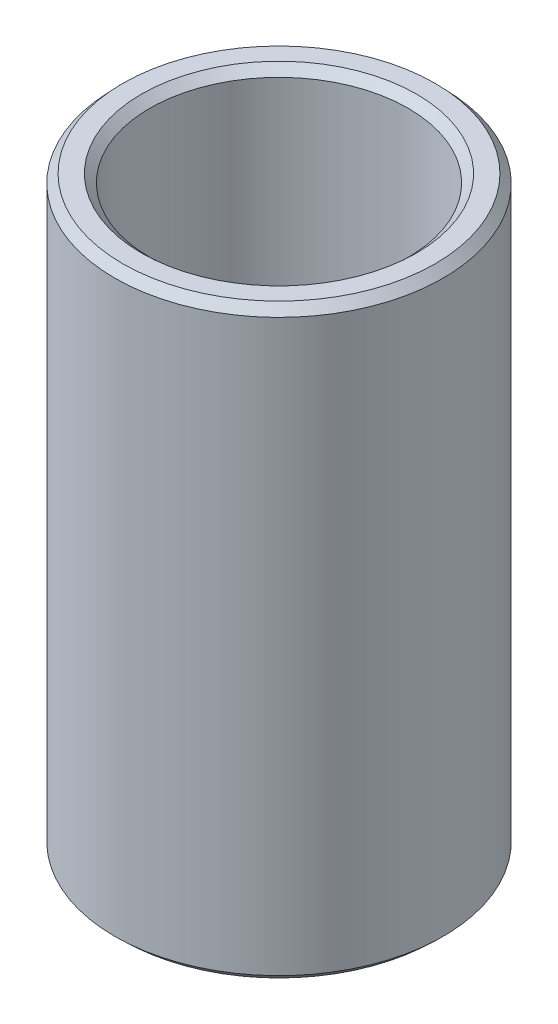
ISO-10303-21;
HEADER;
FILE_DESCRIPTION(('STEP AP214'),'2;1');
FILE_NAME('part.step','',(''),(''),'','','');
FILE_SCHEMA(('AUTOMOTIVE_DESIGN { 1 0 10303 214 1 1 1 1 }'));
ENDSEC;
DATA;
#1=APPLICATION_CONTEXT('core data for automotive mechanical design processes');
#2=APPLICATION_PROTOCOL_DEFINITION('international standard','automotive_design',2000,#1);
#3=PRODUCT_CONTEXT('',#1,'mechanical');
#4=PRODUCT('Part','Part','',(#3));
#5=PRODUCT_RELATED_PRODUCT_CATEGORY('part','',(#4));
#6=PRODUCT_DEFINITION_FORMATION('','',#4);
#7=PRODUCT_DEFINITION_CONTEXT('part definition',#1,'design');
#8=PRODUCT_DEFINITION('design','',#6,#7);
#9=PRODUCT_DEFINITION_SHAPE('','',#8);
#10=(LENGTH_UNIT() NAMED_UNIT(*) SI_UNIT(.MILLI.,.METRE.));
#11=(NAMED_UNIT(*) PLANE_ANGLE_UNIT() SI_UNIT($,.RADIAN.));
#12=(NAMED_UNIT(*) SI_UNIT($,.STERADIAN.) SOLID_ANGLE_UNIT());
#13=UNCERTAINTY_MEASURE_WITH_UNIT(LENGTH_MEASURE(1.E-05),#10,'distance_accuracy_value','');
#14=(GEOMETRIC_REPRESENTATION_CONTEXT(3) GLOBAL_UNCERTAINTY_ASSIGNED_CONTEXT((#13)) GLOBAL_UNIT_ASSIGNED_CONTEXT((#10,
#11,#12)) REPRESENTATION_CONTEXT('',''));
#15=CARTESIAN_POINT('',(0.,0.,0.));
#16=DIRECTION('',(0.,0.,1.));
#17=DIRECTION('',(1.,0.,0.));
#18=AXIS2_PLACEMENT_3D('',#15,#16,#17);
#19=CARTESIAN_POINT('',(0.,205.373040129439,0.));
#20=DIRECTION('',(0.,-1.,0.));
#21=DIRECTION('',(0.,0.,-1.));
#22=AXIS2_PLACEMENT_3D('',#19,#20,#21);
#23=CYLINDRICAL_SURFACE('',#22,57.5);
#24=CARTESIAN_POINT('',(0.,2.7920993462775,0.));
#25=DIRECTION('',(0.,1.,0.));
#26=DIRECTION('',(0.,0.,1.));
#27=AXIS2_PLACEMENT_3D('',#24,#25,#26);
#28=CIRCLE('',#27,57.5);
#29=CARTESIAN_POINT('',(0.,2.7920993462775,57.5));
#30=VERTEX_POINT('',#29);
#31=EDGE_CURVE('E10',#30,#30,#28,.T.);
#32=ORIENTED_EDGE('',*,*,#31,.T.);
#33=EDGE_LOOP('',(#32));
#34=FACE_BOUND('',#33,.T.);
#35=CARTESIAN_POINT('',(0.,202.413347364152,0.));
#36=DIRECTION('',(0.,1.,0.));
#37=DIRECTION('',(0.,0.,1.));
#38=AXIS2_PLACEMENT_3D('',#35,#36,#37);
#39=CIRCLE('',#38,57.5);
#40=CARTESIAN_POINT('',(0.,202.413347364152,-57.5));
#41=VERTEX_POINT('',#40);
#42=EDGE_CURVE('E50',#41,#41,#39,.F.);
#43=ORIENTED_EDGE('',*,*,#42,.T.);
#44=EDGE_LOOP('',(#43));
#45=FACE_BOUND('',#44,.T.);
#46=ADVANCED_FACE('F39',(#34,#45),#23,.T.);
#47=CARTESIAN_POINT('',(0.,205.373040129439,0.));
#48=DIRECTION('',(0.,1.,0.));
#49=DIRECTION('',(0.,0.,1.));
#50=AXIS2_PLACEMENT_3D('',#47,#48,#49);
#51=PLANE('',#50);
#52=CARTESIAN_POINT('',(0.,205.373040129439,0.));
#53=DIRECTION('',(0.,1.,0.));
#54=DIRECTION('',(0.,0.,1.));
#55=AXIS2_PLACEMENT_3D('',#52,#53,#54);
#56=CIRCLE('',#55,48.1834346604922);
#57=CARTESIAN_POINT('',(0.,205.373040129439,48.1834346604922));
#58=VERTEX_POINT('',#57);
#59=EDGE_CURVE('E58',#58,#58,#56,.F.);
#60=ORIENTED_EDGE('',*,*,#59,.T.);
#61=EDGE_LOOP('',(#60));
#62=FACE_BOUND('',#61,.T.);
#63=CARTESIAN_POINT('',(0.,205.373040129439,0.));
#64=DIRECTION('',(0.,1.,0.));
#65=DIRECTION('',(0.,0.,1.));
#66=AXIS2_PLACEMENT_3D('',#63,#64,#65);
#67=CIRCLE('',#66,54.7079006537225);
#68=CARTESIAN_POINT('',(0.,205.373040129439,-54.7079006537225));
#69=VERTEX_POINT('',#68);
#70=EDGE_CURVE('E61',#69,#69,#67,.T.);
#71=ORIENTED_EDGE('',*,*,#70,.T.);
#72=EDGE_LOOP('',(#71));
#73=FACE_BOUND('',#72,.T.);
#74=ADVANCED_FACE('F88',(#62,#73),#51,.T.);
#75=CARTESIAN_POINT('',(0.,0.,0.));
#76=DIRECTION('',(0.,1.,0.));
#77=DIRECTION('',(0.,0.,1.));
#78=AXIS2_PLACEMENT_3D('',#75,#76,#77);
#79=PLANE('',#78);
#80=CARTESIAN_POINT('',(0.,0.,0.));
#81=DIRECTION('',(0.,1.,0.));
#82=DIRECTION('',(0.,0.,1.));
#83=AXIS2_PLACEMENT_3D('',#80,#81,#82);
#84=CIRCLE('',#83,48.015841241483);
#85=CARTESIAN_POINT('',(0.,0.,48.015841241483));
#86=VERTEX_POINT('',#85);
#87=EDGE_CURVE('E51',#86,#86,#84,.T.);
#88=ORIENTED_EDGE('',*,*,#87,.T.);
#89=EDGE_LOOP('',(#88));
#90=FACE_BOUND('',#89,.T.);
#91=CARTESIAN_POINT('',(0.,0.,0.));
#92=DIRECTION('',(0.,1.,0.));
#93=DIRECTION('',(0.,0.,1.));
#94=AXIS2_PLACEMENT_3D('',#91,#92,#93);
#95=CIRCLE('',#94,54.5403072347133);
#96=CARTESIAN_POINT('',(0.,0.,54.5403072347133));
#97=VERTEX_POINT('',#96);
#98=EDGE_CURVE('E54',#97,#97,#95,.F.);
#99=ORIENTED_EDGE('',*,*,#98,.T.);
#100=EDGE_LOOP('',(#99));
#101=FACE_BOUND('',#100,.T.);
#102=ADVANCED_FACE('F83',(#90,#101),#79,.F.);
#103=CARTESIAN_POINT('',(0.,205.373040129439,0.));
#104=DIRECTION('',(0.,-1.,0.));
#105=DIRECTION('',(0.,0.,-1.));
#106=AXIS2_PLACEMENT_3D('',#103,#104,#105);
#107=CYLINDRICAL_SURFACE('',#106,45.2237418952055);
#108=CARTESIAN_POINT('',(0.,202.580940783161,0.));
#109=DIRECTION('',(0.,1.,0.));
#110=DIRECTION('',(0.,0.,1.));
#111=AXIS2_PLACEMENT_3D('',#108,#109,#110);
#112=CIRCLE('',#111,45.2237418952055);
#113=CARTESIAN_POINT('',(0.,202.580940783161,45.2237418952055));
#114=VERTEX_POINT('',#113);
#115=EDGE_CURVE('E67',#114,#114,#112,.T.);
#116=ORIENTED_EDGE('',*,*,#115,.T.);
#117=EDGE_LOOP('',(#116));
#118=FACE_BOUND('',#117,.T.);
#119=CARTESIAN_POINT('',(0.,2.95969276528674,0.));
#120=DIRECTION('',(0.,1.,0.));
#121=DIRECTION('',(0.,0.,1.));
#122=AXIS2_PLACEMENT_3D('',#119,#120,#121);
#123=CIRCLE('',#122,45.2237418952055);
#124=CARTESIAN_POINT('',(0.,2.95969276528674,45.2237418952055));
#125=VERTEX_POINT('',#124);
#126=EDGE_CURVE('E69',#125,#125,#123,.F.);
#127=ORIENTED_EDGE('',*,*,#126,.T.);
#128=EDGE_LOOP('',(#127));
#129=FACE_BOUND('',#128,.T.);
#130=ADVANCED_FACE('F71',(#118,#129),#107,.F.);
#131=CARTESIAN_POINT('',(0.,202.580940783161,0.));
#132=DIRECTION('',(0.,1.,0.));
#133=DIRECTION('',(0.,0.,1.));
#134=AXIS2_PLACEMENT_3D('',#131,#132,#133);
#135=CONICAL_SURFACE('',#134,45.2237418952055,0.814527521862024);
#136=ORIENTED_EDGE('',*,*,#59,.F.);
#137=EDGE_LOOP('',(#136));
#138=FACE_BOUND('',#137,.T.);
#139=ORIENTED_EDGE('',*,*,#115,.F.);
#140=EDGE_LOOP('',(#139));
#141=FACE_BOUND('',#140,.T.);
#142=ADVANCED_FACE('F77',(#138,#141),#135,.F.);
#143=CARTESIAN_POINT('',(0.,0.,0.));
#144=DIRECTION('',(0.,-1.,0.));
#145=DIRECTION('',(0.,0.,-1.));
#146=AXIS2_PLACEMENT_3D('',#143,#144,#145);
#147=CONICAL_SURFACE('',#146,48.015841241483,0.75626880493287);
#148=ORIENTED_EDGE('',*,*,#126,.F.);
#149=EDGE_LOOP('',(#148));
#150=FACE_BOUND('',#149,.T.);
#151=ORIENTED_EDGE('',*,*,#87,.F.);
#152=EDGE_LOOP('',(#151));
#153=FACE_BOUND('',#152,.T.);
#154=ADVANCED_FACE('F73',(#150,#153),#147,.F.);
#155=CARTESIAN_POINT('',(0.,2.7920993462775,0.));
#156=DIRECTION('',(0.,1.,0.));
#157=DIRECTION('',(0.,0.,1.));
#158=AXIS2_PLACEMENT_3D('',#155,#156,#157);
#159=CONICAL_SURFACE('',#158,57.5,0.814527521862022);
#160=ORIENTED_EDGE('',*,*,#98,.F.);
#161=EDGE_LOOP('',(#160));
#162=FACE_BOUND('',#161,.T.);
#163=ORIENTED_EDGE('',*,*,#31,.F.);
#164=EDGE_LOOP('',(#163));
#165=FACE_BOUND('',#164,.T.);
#166=ADVANCED_FACE('F76',(#162,#165),#159,.T.);
#167=CARTESIAN_POINT('',(0.,205.373040129439,0.));
#168=DIRECTION('',(0.,-1.,0.));
#169=DIRECTION('',(0.,0.,-1.));
#170=AXIS2_PLACEMENT_3D('',#167,#168,#169);
#171=CONICAL_SURFACE('',#170,54.7079006537225,0.756268804932881);
#172=CARTESIAN_POINT('',(0.,202.413347364152,-57.5));
#173=CARTESIAN_POINT('',(0.,202.444177497124,-57.4709156318096));
#174=CARTESIAN_POINT('',(0.,202.475007630096,-57.4418312636192));
#175=CARTESIAN_POINT('',(0.,202.536667896039,-57.3836625272385));
#176=CARTESIAN_POINT('',(0.,202.567498029011,-57.3545781590481));
#177=CARTESIAN_POINT('',(0.,202.629158294954,-57.2964094226673));
#178=CARTESIAN_POINT('',(0.,202.659988427926,-57.2673250544769));
#179=CARTESIAN_POINT('',(0.,202.72164869387,-57.2091563180961));
#180=CARTESIAN_POINT('',(0.,202.752478826841,-57.1800719499057));
#181=CARTESIAN_POINT('',(0.,202.814139092785,-57.1219032135249));
#182=CARTESIAN_POINT('',(0.,202.844969225756,-57.0928188453345));
#183=CARTESIAN_POINT('',(0.,202.9066294917,-57.0346501089538));
#184=CARTESIAN_POINT('',(0.,202.937459624672,-57.0055657407634));
#185=CARTESIAN_POINT('',(0.,202.999119890615,-56.9473970043826));
#186=CARTESIAN_POINT('',(0.,203.029950023587,-56.9183126361922));
#187=CARTESIAN_POINT('',(0.,203.09161028953,-56.8601438998114));
#188=CARTESIAN_POINT('',(0.,203.122440422502,-56.831059531621));
#189=CARTESIAN_POINT('',(0.,203.184100688446,-56.7728907952402));
#190=CARTESIAN_POINT('',(0.,203.214930821417,-56.7438064270499));
#191=CARTESIAN_POINT('',(0.,203.276591087361,-56.6856376906691));
#192=CARTESIAN_POINT('',(0.,203.307421220333,-56.6565533224787));
#193=CARTESIAN_POINT('',(0.,203.369081486276,-56.5983845860979));
#194=CARTESIAN_POINT('',(0.,203.399911619248,-56.5693002179075));
#195=CARTESIAN_POINT('',(0.,203.461571885191,-56.5111314815267));
#196=CARTESIAN_POINT('',(0.,203.492402018163,-56.4820471133363));
#197=CARTESIAN_POINT('',(0.,203.554062284106,-56.4238783769556));
#198=CARTESIAN_POINT('',(0.,203.584892417078,-56.3947940087652));
#199=CARTESIAN_POINT('',(0.,203.646552683022,-56.3366252723844));
#200=CARTESIAN_POINT('',(0.,203.677382815993,-56.307540904194));
#201=CARTESIAN_POINT('',(0.,203.739043081937,-56.2493721678132));
#202=CARTESIAN_POINT('',(0.,203.769873214909,-56.2202877996228));
#203=CARTESIAN_POINT('',(0.,203.831533480852,-56.162119063242));
#204=CARTESIAN_POINT('',(0.,203.862363613824,-56.1330346950516));
#205=CARTESIAN_POINT('',(0.,203.924023879767,-56.0748659586709));
#206=CARTESIAN_POINT('',(0.,203.954854012739,-56.0457815904805));
#207=CARTESIAN_POINT('',(0.,204.016514278682,-55.9876128540997));
#208=CARTESIAN_POINT('',(0.,204.047344411654,-55.9585284859093));
#209=CARTESIAN_POINT('',(0.,204.109004677598,-55.9003597495285));
#210=CARTESIAN_POINT('',(0.,204.139834810569,-55.8712753813381));
#211=CARTESIAN_POINT('',(0.,204.201495076513,-55.8131066449573));
#212=CARTESIAN_POINT('',(0.,204.232325209485,-55.784022276767));
#213=CARTESIAN_POINT('',(0.,204.293985475428,-55.7258535403862));
#214=CARTESIAN_POINT('',(0.,204.3248156084,-55.6967691721958));
#215=CARTESIAN_POINT('',(0.,204.386475874343,-55.638600435815));
#216=CARTESIAN_POINT('',(0.,204.417306007315,-55.6095160676246));
#217=CARTESIAN_POINT('',(0.,204.478966273258,-55.5513473312438));
#218=CARTESIAN_POINT('',(0.,204.50979640623,-55.5222629630534));
#219=CARTESIAN_POINT('',(0.,204.571456672174,-55.4640942266726));
#220=CARTESIAN_POINT('',(0.,204.602286805145,-55.4350098584823));
#221=CARTESIAN_POINT('',(0.,204.663947071089,-55.3768411221015));
#222=CARTESIAN_POINT('',(0.,204.694777204061,-55.3477567539111));
#223=CARTESIAN_POINT('',(0.,204.756437470004,-55.2895880175303));
#224=CARTESIAN_POINT('',(0.,204.787267602976,-55.2605036493399));
#225=CARTESIAN_POINT('',(0.,204.848927868919,-55.2023349129591));
#226=CARTESIAN_POINT('',(0.,204.879758001891,-55.1732505447687));
#227=CARTESIAN_POINT('',(0.,204.941418267835,-55.115081808388));
#228=CARTESIAN_POINT('',(0.,204.972248400806,-55.0859974401976));
#229=CARTESIAN_POINT('',(0.,205.03390866675,-55.0278287038168));
#230=CARTESIAN_POINT('',(0.,205.064738799721,-54.9987443356264));
#231=CARTESIAN_POINT('',(0.,205.126399065665,-54.9405755992456));
#232=CARTESIAN_POINT('',(0.,205.157229198637,-54.9114912310552));
#233=CARTESIAN_POINT('',(0.,205.21888946458,-54.8533224946744));
#234=CARTESIAN_POINT('',(0.,205.249719597552,-54.824238126484));
#235=CARTESIAN_POINT('',(0.,205.311379863495,-54.7660693901033));
#236=CARTESIAN_POINT('',(0.,205.342209996467,-54.7369850219129));
#237=CARTESIAN_POINT('',(0.,205.373040129439,-54.7079006537225));
#238=B_SPLINE_CURVE_WITH_KNOTS('',3,(#172,#173,#174,#175,#176,#177,#178,#179,#180,#181,#182,
#183,#184,#185,#186,#187,#188,#189,#190,#191,#192,#193,#194,#195,#196,#197,#198,#199,#200,#201,
#202,#203,#204,#205,#206,#207,#208,#209,#210,#211,#212,#213,#214,#215,#216,#217,#218,#219,#220,
#221,#222,#223,#224,#225,#226,#227,#228,#229,#230,#231,#232,#233,#234,#235,#236,#237),
.UNSPECIFIED.,.F.,.F.,(4,2,2,2,2,2,2,2,2,2,2,2,2,2,2,2,2,2,2,2,2,2,2,2,2,2,2,2,2,2,2,2,4),(0.,
0.127151791764046,0.254303583528073,0.381455375292099,0.50860716705612,0.635758958820147,
0.762910750584173,0.890062542348199,1.01721433411223,1.14436612587625,1.27151791764028,
1.3986697094043,1.52582150116833,1.65297329293235,1.78012508469638,1.9072768764604,
2.03442866822443,2.16158045998848,2.2887322517525,2.41588404351653,2.54303583528055,
2.67018762704458,2.7973394188086,2.92449121057263,3.05164300233665,3.17879479410068,
3.30594658586471,3.43309837762873,3.56025016939276,3.68740196115678,3.81455375292081,
3.94170554468483,4.06885733644888),.UNSPECIFIED.);
#239=EDGE_CURVE('BSEAM45',#41,#69,#238,.T.);
#240=ORIENTED_EDGE('',*,*,#42,.F.);
#241=ORIENTED_EDGE('',*,*,#70,.F.);
#242=ORIENTED_EDGE('',*,*,#239,.T.);
#243=ORIENTED_EDGE('',*,*,#239,.F.);
#244=EDGE_LOOP('',(#240,#242,#241,#243));
#245=FACE_BOUND('',#244,.T.);
#246=ADVANCED_FACE('F45',(#245),#171,.T.);
#247=CLOSED_SHELL('',(#46,#74,#102,#130,#142,#154,#166,#246));
#248=MANIFOLD_SOLID_BREP('B2',#247);
#249=ADVANCED_BREP_SHAPE_REPRESENTATION('',(#18,#248),#14);
#250=SHAPE_DEFINITION_REPRESENTATION(#9,#249);
ENDSEC;
END-ISO-10303-21;
